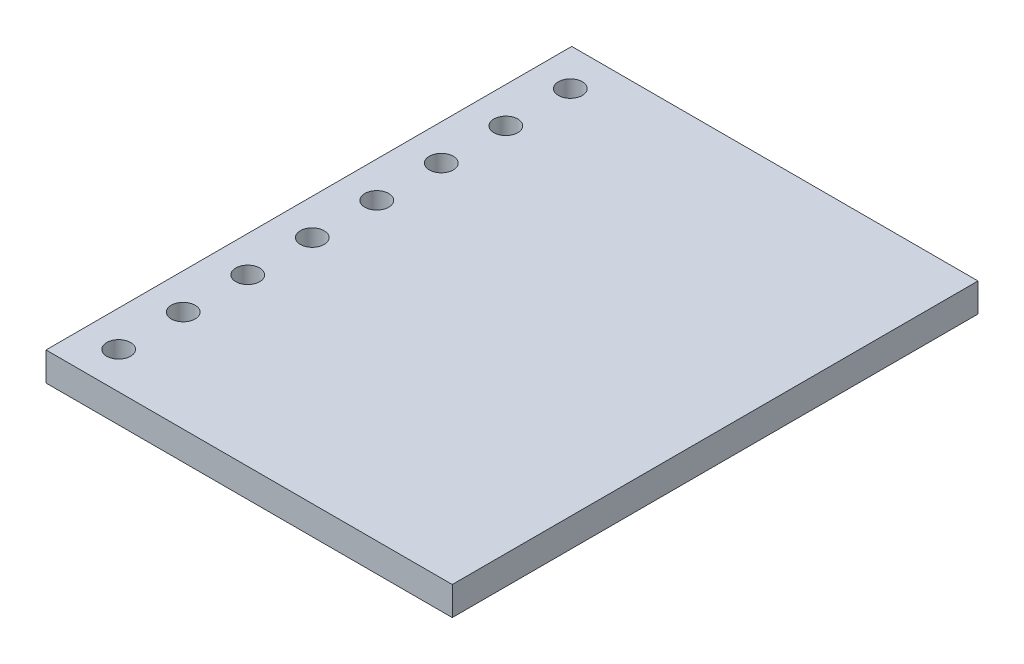
ISO-10303-21;
HEADER;
FILE_DESCRIPTION(('STEP AP214'),'2;1');
FILE_NAME('part.step','',(''),(''),'','','');
FILE_SCHEMA(('AUTOMOTIVE_DESIGN { 1 0 10303 214 1 1 1 1 }'));
ENDSEC;
DATA;
#1=APPLICATION_CONTEXT('core data for automotive mechanical design processes');
#2=APPLICATION_PROTOCOL_DEFINITION('international standard','automotive_design',2000,#1);
#3=PRODUCT_CONTEXT('',#1,'mechanical');
#4=PRODUCT('Part','Part','',(#3));
#5=PRODUCT_RELATED_PRODUCT_CATEGORY('part','',(#4));
#6=PRODUCT_DEFINITION_FORMATION('','',#4);
#7=PRODUCT_DEFINITION_CONTEXT('part definition',#1,'design');
#8=PRODUCT_DEFINITION('design','',#6,#7);
#9=PRODUCT_DEFINITION_SHAPE('','',#8);
#10=(LENGTH_UNIT() NAMED_UNIT(*) SI_UNIT(.MILLI.,.METRE.));
#11=(NAMED_UNIT(*) PLANE_ANGLE_UNIT() SI_UNIT($,.RADIAN.));
#12=(NAMED_UNIT(*) SI_UNIT($,.STERADIAN.) SOLID_ANGLE_UNIT());
#13=UNCERTAINTY_MEASURE_WITH_UNIT(LENGTH_MEASURE(1.E-05),#10,'distance_accuracy_value','');
#14=(GEOMETRIC_REPRESENTATION_CONTEXT(3) GLOBAL_UNCERTAINTY_ASSIGNED_CONTEXT((#13)) GLOBAL_UNIT_ASSIGNED_CONTEXT((#10,
#11,#12)) REPRESENTATION_CONTEXT('',''));
#15=CARTESIAN_POINT('',(0.,0.,0.));
#16=DIRECTION('',(0.,0.,1.));
#17=DIRECTION('',(1.,0.,0.));
#18=AXIS2_PLACEMENT_3D('',#15,#16,#17);
#19=CARTESIAN_POINT('',(0.,1.2,0.));
#20=DIRECTION('',(0.,-1.,0.));
#21=DIRECTION('',(0.,0.,-1.));
#22=AXIS2_PLACEMENT_3D('',#19,#20,#21);
#23=PLANE('',#22);
#24=DIRECTION('',(0.,0.,1.));
#25=VECTOR('',#24,1.);
#26=CARTESIAN_POINT('',(0.,1.2,0.));
#27=LINE('',#26,#25);
#28=CARTESIAN_POINT('',(0.,1.2,-22.));
#29=VERTEX_POINT('',#28);
#30=CARTESIAN_POINT('',(0.,1.2,0.));
#31=VERTEX_POINT('',#30);
#32=EDGE_CURVE('E90',#29,#31,#27,.T.);
#33=ORIENTED_EDGE('',*,*,#32,.T.);
#34=DIRECTION('',(1.,0.,0.));
#35=VECTOR('',#34,1.);
#36=CARTESIAN_POINT('',(0.,1.2,0.));
#37=LINE('',#36,#35);
#38=CARTESIAN_POINT('',(17.,1.2,0.));
#39=VERTEX_POINT('',#38);
#40=EDGE_CURVE('E85',#31,#39,#37,.T.);
#41=ORIENTED_EDGE('',*,*,#40,.T.);
#42=DIRECTION('',(0.,0.,-1.));
#43=VECTOR('',#42,1.);
#44=CARTESIAN_POINT('',(17.,1.2,0.));
#45=LINE('',#44,#43);
#46=CARTESIAN_POINT('',(17.,1.2,-22.));
#47=VERTEX_POINT('',#46);
#48=EDGE_CURVE('E88',#39,#47,#45,.T.);
#49=ORIENTED_EDGE('',*,*,#48,.T.);
#50=DIRECTION('',(-1.,0.,0.));
#51=VECTOR('',#50,1.);
#52=CARTESIAN_POINT('',(0.,1.2,-22.));
#53=LINE('',#52,#51);
#54=EDGE_CURVE('E55',#47,#29,#53,.T.);
#55=ORIENTED_EDGE('',*,*,#54,.T.);
#56=EDGE_LOOP('',(#33,#41,#49,#55));
#57=FACE_BOUND('',#56,.T.);
#58=CARTESIAN_POINT('',(1.5,1.2,-20.4418080733065));
#59=DIRECTION('',(0.,1.,0.));
#60=DIRECTION('',(0.,0.,1.));
#61=AXIS2_PLACEMENT_3D('',#58,#59,#60);
#62=CIRCLE('',#61,0.5);
#63=CARTESIAN_POINT('',(1.5,1.2,-19.9418080733065));
#64=VERTEX_POINT('',#63);
#65=EDGE_CURVE('E105',#64,#64,#62,.T.);
#66=ORIENTED_EDGE('',*,*,#65,.F.);
#67=EDGE_LOOP('',(#66));
#68=FACE_BOUND('',#67,.T.);
#69=CARTESIAN_POINT('',(1.5,1.2,-17.7418080733065));
#70=DIRECTION('',(0.,1.,0.));
#71=DIRECTION('',(0.,0.,1.));
#72=AXIS2_PLACEMENT_3D('',#69,#70,#71);
#73=CIRCLE('',#72,0.5);
#74=CARTESIAN_POINT('',(1.5,1.2,-17.2418080733065));
#75=VERTEX_POINT('',#74);
#76=EDGE_CURVE('E120',#75,#75,#73,.T.);
#77=ORIENTED_EDGE('',*,*,#76,.F.);
#78=EDGE_LOOP('',(#77));
#79=FACE_BOUND('',#78,.T.);
#80=CARTESIAN_POINT('',(1.5,1.2,-15.0418080733065));
#81=DIRECTION('',(0.,1.,0.));
#82=DIRECTION('',(0.,0.,1.));
#83=AXIS2_PLACEMENT_3D('',#80,#81,#82);
#84=CIRCLE('',#83,0.5);
#85=CARTESIAN_POINT('',(1.5,1.2,-14.5418080733065));
#86=VERTEX_POINT('',#85);
#87=EDGE_CURVE('E126',#86,#86,#84,.T.);
#88=ORIENTED_EDGE('',*,*,#87,.F.);
#89=EDGE_LOOP('',(#88));
#90=FACE_BOUND('',#89,.T.);
#91=CARTESIAN_POINT('',(1.5,1.2,-12.3418080733065));
#92=DIRECTION('',(0.,1.,0.));
#93=DIRECTION('',(0.,0.,1.));
#94=AXIS2_PLACEMENT_3D('',#91,#92,#93);
#95=CIRCLE('',#94,0.5);
#96=CARTESIAN_POINT('',(1.5,1.2,-11.8418080733065));
#97=VERTEX_POINT('',#96);
#98=EDGE_CURVE('E132',#97,#97,#95,.T.);
#99=ORIENTED_EDGE('',*,*,#98,.F.);
#100=EDGE_LOOP('',(#99));
#101=FACE_BOUND('',#100,.T.);
#102=CARTESIAN_POINT('',(1.5,1.2,-9.64180807330654));
#103=DIRECTION('',(0.,1.,0.));
#104=DIRECTION('',(0.,0.,1.));
#105=AXIS2_PLACEMENT_3D('',#102,#103,#104);
#106=CIRCLE('',#105,0.5);
#107=CARTESIAN_POINT('',(1.5,1.2,-9.14180807330654));
#108=VERTEX_POINT('',#107);
#109=EDGE_CURVE('E138',#108,#108,#106,.T.);
#110=ORIENTED_EDGE('',*,*,#109,.F.);
#111=EDGE_LOOP('',(#110));
#112=FACE_BOUND('',#111,.T.);
#113=CARTESIAN_POINT('',(1.5,1.2,-6.94180807330654));
#114=DIRECTION('',(0.,1.,0.));
#115=DIRECTION('',(0.,0.,1.));
#116=AXIS2_PLACEMENT_3D('',#113,#114,#115);
#117=CIRCLE('',#116,0.5);
#118=CARTESIAN_POINT('',(1.5,1.2,-6.44180807330654));
#119=VERTEX_POINT('',#118);
#120=EDGE_CURVE('E144',#119,#119,#117,.T.);
#121=ORIENTED_EDGE('',*,*,#120,.F.);
#122=EDGE_LOOP('',(#121));
#123=FACE_BOUND('',#122,.T.);
#124=CARTESIAN_POINT('',(1.5,1.2,-4.24180807330654));
#125=DIRECTION('',(0.,1.,0.));
#126=DIRECTION('',(0.,0.,1.));
#127=AXIS2_PLACEMENT_3D('',#124,#125,#126);
#128=CIRCLE('',#127,0.5);
#129=CARTESIAN_POINT('',(1.5,1.2,-3.74180807330654));
#130=VERTEX_POINT('',#129);
#131=EDGE_CURVE('E150',#130,#130,#128,.T.);
#132=ORIENTED_EDGE('',*,*,#131,.F.);
#133=EDGE_LOOP('',(#132));
#134=FACE_BOUND('',#133,.T.);
#135=CARTESIAN_POINT('',(1.5,1.2,-1.54180807330655));
#136=DIRECTION('',(0.,1.,0.));
#137=DIRECTION('',(0.,0.,1.));
#138=AXIS2_PLACEMENT_3D('',#135,#136,#137);
#139=CIRCLE('',#138,0.5);
#140=CARTESIAN_POINT('',(1.5,1.2,-1.04180807330655));
#141=VERTEX_POINT('',#140);
#142=EDGE_CURVE('E156',#141,#141,#139,.T.);
#143=ORIENTED_EDGE('',*,*,#142,.F.);
#144=EDGE_LOOP('',(#143));
#145=FACE_BOUND('',#144,.T.);
#146=ADVANCED_FACE('F38',(#57,#68,#79,#90,#101,#112,#123,#134,#145),#23,.F.);
#147=CARTESIAN_POINT('',(0.,0.,0.));
#148=DIRECTION('',(0.,-1.,0.));
#149=DIRECTION('',(0.,0.,-1.));
#150=AXIS2_PLACEMENT_3D('',#147,#148,#149);
#151=PLANE('',#150);
#152=CARTESIAN_POINT('',(1.5,0.,-4.24180807330654));
#153=DIRECTION('',(0.,1.,0.));
#154=DIRECTION('',(0.,0.,1.));
#155=AXIS2_PLACEMENT_3D('',#152,#153,#154);
#156=CIRCLE('',#155,0.5);
#157=CARTESIAN_POINT('',(1.5,0.,-3.74180807330654));
#158=VERTEX_POINT('',#157);
#159=EDGE_CURVE('E153',#158,#158,#156,.T.);
#160=ORIENTED_EDGE('',*,*,#159,.T.);
#161=EDGE_LOOP('',(#160));
#162=FACE_BOUND('',#161,.T.);
#163=CARTESIAN_POINT('',(1.5,0.,-9.64180807330654));
#164=DIRECTION('',(0.,1.,0.));
#165=DIRECTION('',(0.,0.,1.));
#166=AXIS2_PLACEMENT_3D('',#163,#164,#165);
#167=CIRCLE('',#166,0.5);
#168=CARTESIAN_POINT('',(1.5,0.,-9.14180807330654));
#169=VERTEX_POINT('',#168);
#170=EDGE_CURVE('E141',#169,#169,#167,.T.);
#171=ORIENTED_EDGE('',*,*,#170,.T.);
#172=EDGE_LOOP('',(#171));
#173=FACE_BOUND('',#172,.T.);
#174=CARTESIAN_POINT('',(1.5,0.,-15.0418080733065));
#175=DIRECTION('',(0.,1.,0.));
#176=DIRECTION('',(0.,0.,1.));
#177=AXIS2_PLACEMENT_3D('',#174,#175,#176);
#178=CIRCLE('',#177,0.5);
#179=CARTESIAN_POINT('',(1.5,0.,-14.5418080733065));
#180=VERTEX_POINT('',#179);
#181=EDGE_CURVE('E129',#180,#180,#178,.T.);
#182=ORIENTED_EDGE('',*,*,#181,.T.);
#183=EDGE_LOOP('',(#182));
#184=FACE_BOUND('',#183,.T.);
#185=CARTESIAN_POINT('',(1.5,0.,-20.4418080733065));
#186=DIRECTION('',(0.,1.,0.));
#187=DIRECTION('',(0.,0.,1.));
#188=AXIS2_PLACEMENT_3D('',#185,#186,#187);
#189=CIRCLE('',#188,0.5);
#190=CARTESIAN_POINT('',(1.5,0.,-19.9418080733065));
#191=VERTEX_POINT('',#190);
#192=EDGE_CURVE('E117',#191,#191,#189,.T.);
#193=ORIENTED_EDGE('',*,*,#192,.T.);
#194=EDGE_LOOP('',(#193));
#195=FACE_BOUND('',#194,.T.);
#196=DIRECTION('',(0.,0.,1.));
#197=VECTOR('',#196,1.);
#198=CARTESIAN_POINT('',(0.,0.,0.));
#199=LINE('',#198,#197);
#200=CARTESIAN_POINT('',(0.,0.,-22.));
#201=VERTEX_POINT('',#200);
#202=CARTESIAN_POINT('',(0.,0.,0.));
#203=VERTEX_POINT('',#202);
#204=EDGE_CURVE('E102',#201,#203,#199,.T.);
#205=ORIENTED_EDGE('',*,*,#204,.F.);
#206=DIRECTION('',(-1.,0.,0.));
#207=VECTOR('',#206,1.);
#208=CARTESIAN_POINT('',(0.,0.,-22.));
#209=LINE('',#208,#207);
#210=CARTESIAN_POINT('',(17.,0.,-22.));
#211=VERTEX_POINT('',#210);
#212=EDGE_CURVE('E78',#211,#201,#209,.T.);
#213=ORIENTED_EDGE('',*,*,#212,.F.);
#214=DIRECTION('',(0.,0.,-1.));
#215=VECTOR('',#214,1.);
#216=CARTESIAN_POINT('',(17.,0.,0.));
#217=LINE('',#216,#215);
#218=CARTESIAN_POINT('',(17.,0.,0.));
#219=VERTEX_POINT('',#218);
#220=EDGE_CURVE('E72',#219,#211,#217,.T.);
#221=ORIENTED_EDGE('',*,*,#220,.F.);
#222=DIRECTION('',(1.,0.,0.));
#223=VECTOR('',#222,1.);
#224=CARTESIAN_POINT('',(0.,0.,0.));
#225=LINE('',#224,#223);
#226=EDGE_CURVE('E94',#203,#219,#225,.T.);
#227=ORIENTED_EDGE('',*,*,#226,.F.);
#228=EDGE_LOOP('',(#205,#213,#221,#227));
#229=FACE_BOUND('',#228,.T.);
#230=CARTESIAN_POINT('',(1.5,0.,-17.7418080733065));
#231=DIRECTION('',(0.,1.,0.));
#232=DIRECTION('',(0.,0.,1.));
#233=AXIS2_PLACEMENT_3D('',#230,#231,#232);
#234=CIRCLE('',#233,0.5);
#235=CARTESIAN_POINT('',(1.5,0.,-17.2418080733065));
#236=VERTEX_POINT('',#235);
#237=EDGE_CURVE('E123',#236,#236,#234,.T.);
#238=ORIENTED_EDGE('',*,*,#237,.T.);
#239=EDGE_LOOP('',(#238));
#240=FACE_BOUND('',#239,.T.);
#241=CARTESIAN_POINT('',(1.5,0.,-12.3418080733065));
#242=DIRECTION('',(0.,1.,0.));
#243=DIRECTION('',(0.,0.,1.));
#244=AXIS2_PLACEMENT_3D('',#241,#242,#243);
#245=CIRCLE('',#244,0.5);
#246=CARTESIAN_POINT('',(1.5,0.,-11.8418080733065));
#247=VERTEX_POINT('',#246);
#248=EDGE_CURVE('E135',#247,#247,#245,.T.);
#249=ORIENTED_EDGE('',*,*,#248,.T.);
#250=EDGE_LOOP('',(#249));
#251=FACE_BOUND('',#250,.T.);
#252=CARTESIAN_POINT('',(1.5,0.,-6.94180807330654));
#253=DIRECTION('',(0.,1.,0.));
#254=DIRECTION('',(0.,0.,1.));
#255=AXIS2_PLACEMENT_3D('',#252,#253,#254);
#256=CIRCLE('',#255,0.5);
#257=CARTESIAN_POINT('',(1.5,0.,-6.44180807330654));
#258=VERTEX_POINT('',#257);
#259=EDGE_CURVE('E147',#258,#258,#256,.T.);
#260=ORIENTED_EDGE('',*,*,#259,.T.);
#261=EDGE_LOOP('',(#260));
#262=FACE_BOUND('',#261,.T.);
#263=CARTESIAN_POINT('',(1.5,0.,-1.54180807330655));
#264=DIRECTION('',(0.,1.,0.));
#265=DIRECTION('',(0.,0.,1.));
#266=AXIS2_PLACEMENT_3D('',#263,#264,#265);
#267=CIRCLE('',#266,0.5);
#268=CARTESIAN_POINT('',(1.5,0.,-1.04180807330655));
#269=VERTEX_POINT('',#268);
#270=EDGE_CURVE('E159',#269,#269,#267,.T.);
#271=ORIENTED_EDGE('',*,*,#270,.T.);
#272=EDGE_LOOP('',(#271));
#273=FACE_BOUND('',#272,.T.);
#274=ADVANCED_FACE('F113',(#162,#173,#184,#195,#229,#240,#251,#262,#273),#151,.T.);
#275=CARTESIAN_POINT('',(0.,1.2,0.));
#276=DIRECTION('',(1.,0.,0.));
#277=DIRECTION('',(0.,0.,-1.));
#278=AXIS2_PLACEMENT_3D('',#275,#276,#277);
#279=PLANE('',#278);
#280=ORIENTED_EDGE('',*,*,#204,.T.);
#281=DIRECTION('',(0.,-1.,0.));
#282=VECTOR('',#281,1.);
#283=CARTESIAN_POINT('',(0.,1.2,0.));
#284=LINE('',#283,#282);
#285=EDGE_CURVE('E11',#31,#203,#284,.T.);
#286=ORIENTED_EDGE('',*,*,#285,.F.);
#287=ORIENTED_EDGE('',*,*,#32,.F.);
#288=DIRECTION('',(0.,-1.,0.));
#289=VECTOR('',#288,1.);
#290=CARTESIAN_POINT('',(0.,1.2,-22.));
#291=LINE('',#290,#289);
#292=EDGE_CURVE('E98',#29,#201,#291,.T.);
#293=ORIENTED_EDGE('',*,*,#292,.T.);
#294=EDGE_LOOP('',(#280,#286,#287,#293));
#295=FACE_BOUND('',#294,.T.);
#296=ADVANCED_FACE('F40',(#295),#279,.F.);
#297=CARTESIAN_POINT('',(0.,1.2,0.));
#298=DIRECTION('',(0.,0.,-1.));
#299=DIRECTION('',(-1.,0.,0.));
#300=AXIS2_PLACEMENT_3D('',#297,#298,#299);
#301=PLANE('',#300);
#302=ORIENTED_EDGE('',*,*,#226,.T.);
#303=DIRECTION('',(0.,-1.,0.));
#304=VECTOR('',#303,1.);
#305=CARTESIAN_POINT('',(17.,1.2,0.));
#306=LINE('',#305,#304);
#307=EDGE_CURVE('E47',#39,#219,#306,.T.);
#308=ORIENTED_EDGE('',*,*,#307,.F.);
#309=ORIENTED_EDGE('',*,*,#40,.F.);
#310=ORIENTED_EDGE('',*,*,#285,.T.);
#311=EDGE_LOOP('',(#302,#308,#309,#310));
#312=FACE_BOUND('',#311,.T.);
#313=ADVANCED_FACE('F93',(#312),#301,.F.);
#314=CARTESIAN_POINT('',(17.,1.2,0.));
#315=DIRECTION('',(-1.,0.,0.));
#316=DIRECTION('',(0.,0.,1.));
#317=AXIS2_PLACEMENT_3D('',#314,#315,#316);
#318=PLANE('',#317);
#319=ORIENTED_EDGE('',*,*,#220,.T.);
#320=DIRECTION('',(0.,-1.,0.));
#321=VECTOR('',#320,1.);
#322=CARTESIAN_POINT('',(17.,1.2,-22.));
#323=LINE('',#322,#321);
#324=EDGE_CURVE('E95',#47,#211,#323,.T.);
#325=ORIENTED_EDGE('',*,*,#324,.F.);
#326=ORIENTED_EDGE('',*,*,#48,.F.);
#327=ORIENTED_EDGE('',*,*,#307,.T.);
#328=EDGE_LOOP('',(#319,#325,#326,#327));
#329=FACE_BOUND('',#328,.T.);
#330=ADVANCED_FACE('F96',(#329),#318,.F.);
#331=CARTESIAN_POINT('',(0.,1.2,-22.));
#332=DIRECTION('',(0.,0.,1.));
#333=DIRECTION('',(1.,0.,0.));
#334=AXIS2_PLACEMENT_3D('',#331,#332,#333);
#335=PLANE('',#334);
#336=ORIENTED_EDGE('',*,*,#212,.T.);
#337=ORIENTED_EDGE('',*,*,#292,.F.);
#338=ORIENTED_EDGE('',*,*,#54,.F.);
#339=ORIENTED_EDGE('',*,*,#324,.T.);
#340=EDGE_LOOP('',(#336,#337,#338,#339));
#341=FACE_BOUND('',#340,.T.);
#342=ADVANCED_FACE('F110',(#341),#335,.F.);
#343=CARTESIAN_POINT('',(1.5,1.2,-20.4418080733065));
#344=DIRECTION('',(0.,-1.,0.));
#345=DIRECTION('',(0.,0.,-1.));
#346=AXIS2_PLACEMENT_3D('',#343,#344,#345);
#347=CYLINDRICAL_SURFACE('',#346,0.5);
#348=ORIENTED_EDGE('',*,*,#65,.T.);
#349=EDGE_LOOP('',(#348));
#350=FACE_BOUND('',#349,.T.);
#351=ORIENTED_EDGE('',*,*,#192,.F.);
#352=EDGE_LOOP('',(#351));
#353=FACE_BOUND('',#352,.T.);
#354=ADVANCED_FACE('F176',(#350,#353),#347,.F.);
#355=CARTESIAN_POINT('',(1.5,1.2,-17.7418080733065));
#356=DIRECTION('',(0.,-1.,0.));
#357=DIRECTION('',(0.,0.,-1.));
#358=AXIS2_PLACEMENT_3D('',#355,#356,#357);
#359=CYLINDRICAL_SURFACE('',#358,0.5);
#360=ORIENTED_EDGE('',*,*,#76,.T.);
#361=EDGE_LOOP('',(#360));
#362=FACE_BOUND('',#361,.T.);
#363=ORIENTED_EDGE('',*,*,#237,.F.);
#364=EDGE_LOOP('',(#363));
#365=FACE_BOUND('',#364,.T.);
#366=ADVANCED_FACE('F230',(#362,#365),#359,.F.);
#367=CARTESIAN_POINT('',(1.5,1.2,-15.0418080733065));
#368=DIRECTION('',(0.,-1.,0.));
#369=DIRECTION('',(0.,0.,-1.));
#370=AXIS2_PLACEMENT_3D('',#367,#368,#369);
#371=CYLINDRICAL_SURFACE('',#370,0.5);
#372=ORIENTED_EDGE('',*,*,#87,.T.);
#373=EDGE_LOOP('',(#372));
#374=FACE_BOUND('',#373,.T.);
#375=ORIENTED_EDGE('',*,*,#181,.F.);
#376=EDGE_LOOP('',(#375));
#377=FACE_BOUND('',#376,.T.);
#378=ADVANCED_FACE('F239',(#374,#377),#371,.F.);
#379=CARTESIAN_POINT('',(1.5,1.2,-12.3418080733065));
#380=DIRECTION('',(0.,-1.,0.));
#381=DIRECTION('',(0.,0.,-1.));
#382=AXIS2_PLACEMENT_3D('',#379,#380,#381);
#383=CYLINDRICAL_SURFACE('',#382,0.5);
#384=ORIENTED_EDGE('',*,*,#98,.T.);
#385=EDGE_LOOP('',(#384));
#386=FACE_BOUND('',#385,.T.);
#387=ORIENTED_EDGE('',*,*,#248,.F.);
#388=EDGE_LOOP('',(#387));
#389=FACE_BOUND('',#388,.T.);
#390=ADVANCED_FACE('F248',(#386,#389),#383,.F.);
#391=CARTESIAN_POINT('',(1.5,1.2,-9.64180807330654));
#392=DIRECTION('',(0.,-1.,0.));
#393=DIRECTION('',(0.,0.,-1.));
#394=AXIS2_PLACEMENT_3D('',#391,#392,#393);
#395=CYLINDRICAL_SURFACE('',#394,0.5);
#396=ORIENTED_EDGE('',*,*,#109,.T.);
#397=EDGE_LOOP('',(#396));
#398=FACE_BOUND('',#397,.T.);
#399=ORIENTED_EDGE('',*,*,#170,.F.);
#400=EDGE_LOOP('',(#399));
#401=FACE_BOUND('',#400,.T.);
#402=ADVANCED_FACE('F258',(#398,#401),#395,.F.);
#403=CARTESIAN_POINT('',(1.5,1.2,-6.94180807330654));
#404=DIRECTION('',(0.,-1.,0.));
#405=DIRECTION('',(0.,0.,-1.));
#406=AXIS2_PLACEMENT_3D('',#403,#404,#405);
#407=CYLINDRICAL_SURFACE('',#406,0.5);
#408=ORIENTED_EDGE('',*,*,#120,.T.);
#409=EDGE_LOOP('',(#408));
#410=FACE_BOUND('',#409,.T.);
#411=ORIENTED_EDGE('',*,*,#259,.F.);
#412=EDGE_LOOP('',(#411));
#413=FACE_BOUND('',#412,.T.);
#414=ADVANCED_FACE('F268',(#410,#413),#407,.F.);
#415=CARTESIAN_POINT('',(1.5,1.2,-4.24180807330654));
#416=DIRECTION('',(0.,-1.,0.));
#417=DIRECTION('',(0.,0.,-1.));
#418=AXIS2_PLACEMENT_3D('',#415,#416,#417);
#419=CYLINDRICAL_SURFACE('',#418,0.5);
#420=ORIENTED_EDGE('',*,*,#131,.T.);
#421=EDGE_LOOP('',(#420));
#422=FACE_BOUND('',#421,.T.);
#423=ORIENTED_EDGE('',*,*,#159,.F.);
#424=EDGE_LOOP('',(#423));
#425=FACE_BOUND('',#424,.T.);
#426=ADVANCED_FACE('F278',(#422,#425),#419,.F.);
#427=CARTESIAN_POINT('',(1.5,1.2,-1.54180807330655));
#428=DIRECTION('',(0.,-1.,0.));
#429=DIRECTION('',(0.,0.,-1.));
#430=AXIS2_PLACEMENT_3D('',#427,#428,#429);
#431=CYLINDRICAL_SURFACE('',#430,0.5);
#432=ORIENTED_EDGE('',*,*,#142,.T.);
#433=EDGE_LOOP('',(#432));
#434=FACE_BOUND('',#433,.T.);
#435=ORIENTED_EDGE('',*,*,#270,.F.);
#436=EDGE_LOOP('',(#435));
#437=FACE_BOUND('',#436,.T.);
#438=ADVANCED_FACE('F165',(#434,#437),#431,.F.);
#439=CLOSED_SHELL('',(#146,#274,#296,#313,#330,#342,#354,#366,#378,#390,#402,#414,#426,#438));
#440=MANIFOLD_SOLID_BREP('B2',#439);
#441=ADVANCED_BREP_SHAPE_REPRESENTATION('',(#18,#440),#14);
#442=SHAPE_DEFINITION_REPRESENTATION(#9,#441);
ENDSEC;
END-ISO-10303-21;
